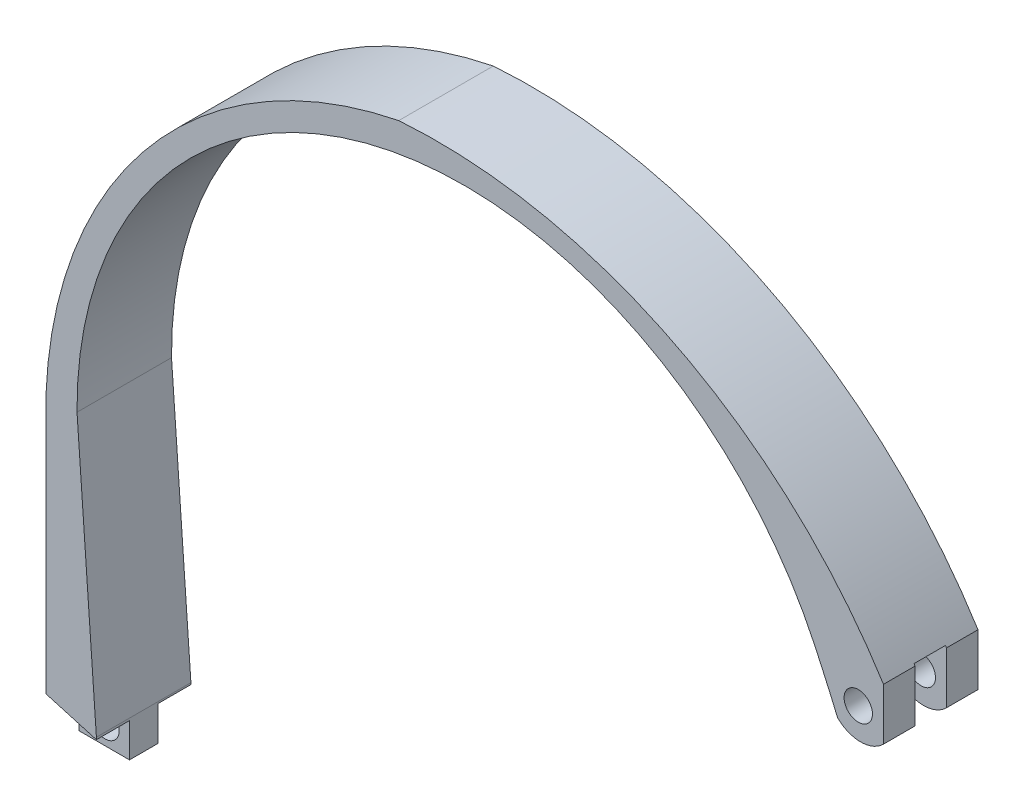
ISO-10303-21;
HEADER;
FILE_DESCRIPTION(('STEP AP214'),'2;1');
FILE_NAME('part.step','',(''),(''),'','','');
FILE_SCHEMA(('AUTOMOTIVE_DESIGN { 1 0 10303 214 1 1 1 1 }'));
ENDSEC;
DATA;
#1=APPLICATION_CONTEXT('core data for automotive mechanical design processes');
#2=APPLICATION_PROTOCOL_DEFINITION('international standard','automotive_design',2000,#1);
#3=PRODUCT_CONTEXT('',#1,'mechanical');
#4=PRODUCT('Part','Part','',(#3));
#5=PRODUCT_RELATED_PRODUCT_CATEGORY('part','',(#4));
#6=PRODUCT_DEFINITION_FORMATION('','',#4);
#7=PRODUCT_DEFINITION_CONTEXT('part definition',#1,'design');
#8=PRODUCT_DEFINITION('design','',#6,#7);
#9=PRODUCT_DEFINITION_SHAPE('','',#8);
#10=(LENGTH_UNIT() NAMED_UNIT(*) SI_UNIT(.MILLI.,.METRE.));
#11=(NAMED_UNIT(*) PLANE_ANGLE_UNIT() SI_UNIT($,.RADIAN.));
#12=(NAMED_UNIT(*) SI_UNIT($,.STERADIAN.) SOLID_ANGLE_UNIT());
#13=UNCERTAINTY_MEASURE_WITH_UNIT(LENGTH_MEASURE(1.E-05),#10,'distance_accuracy_value','');
#14=(GEOMETRIC_REPRESENTATION_CONTEXT(3) GLOBAL_UNCERTAINTY_ASSIGNED_CONTEXT((#13)) GLOBAL_UNIT_ASSIGNED_CONTEXT((#10,
#11,#12)) REPRESENTATION_CONTEXT('',''));
#15=CARTESIAN_POINT('',(0.,0.,0.));
#16=DIRECTION('',(0.,0.,1.));
#17=DIRECTION('',(1.,0.,0.));
#18=AXIS2_PLACEMENT_3D('',#15,#16,#17);
#19=CARTESIAN_POINT('',(41.6817567369252,115.412473793689,-15.));
#20=DIRECTION('',(1.,0.,0.));
#21=DIRECTION('',(0.,0.,-1.));
#22=AXIS2_PLACEMENT_3D('',#19,#20,#21);
#23=PLANE('',#22);
#24=DIRECTION('',(0.,-1.,0.));
#25=VECTOR('',#24,1.);
#26=CARTESIAN_POINT('',(41.6817567369252,115.671014255243,-5.01366928357319));
#27=LINE('',#26,#25);
#28=CARTESIAN_POINT('',(41.6817567369252,115.412473793689,-5.01366928357319));
#29=VERTEX_POINT('',#28);
#30=CARTESIAN_POINT('',(41.6817567369252,107.180744866332,-5.01366928357319));
#31=VERTEX_POINT('',#30);
#32=EDGE_CURVE('E186',#29,#31,#27,.T.);
#33=ORIENTED_EDGE('',*,*,#32,.F.);
#34=DIRECTION('',(0.,0.,1.));
#35=VECTOR('',#34,1.);
#36=CARTESIAN_POINT('',(41.6817567369252,115.412473793689,-15.));
#37=LINE('',#36,#35);
#38=CARTESIAN_POINT('',(41.6817567369252,115.412473793689,0.));
#39=VERTEX_POINT('',#38);
#40=EDGE_CURVE('E192',#29,#39,#37,.T.);
#41=ORIENTED_EDGE('',*,*,#40,.T.);
#42=DIRECTION('',(0.,1.,0.));
#43=VECTOR('',#42,1.);
#44=CARTESIAN_POINT('',(41.6817567369252,115.412473793689,0.));
#45=LINE('',#44,#43);
#46=CARTESIAN_POINT('',(41.6817567369252,107.180744866332,0.));
#47=VERTEX_POINT('',#46);
#48=EDGE_CURVE('E315',#47,#39,#45,.T.);
#49=ORIENTED_EDGE('',*,*,#48,.F.);
#50=DIRECTION('',(0.,0.,1.));
#51=VECTOR('',#50,1.);
#52=CARTESIAN_POINT('',(41.6817567369252,107.180744866332,-15.));
#53=LINE('',#52,#51);
#54=EDGE_CURVE('E193',#31,#47,#53,.T.);
#55=ORIENTED_EDGE('',*,*,#54,.F.);
#56=EDGE_LOOP('',(#33,#41,#49,#55));
#57=FACE_BOUND('',#56,.T.);
#58=ADVANCED_FACE('F32',(#57),#23,.T.);
#59=CARTESIAN_POINT('',(38.0369446201035,110.825556983154,-15.));
#60=DIRECTION('',(0.,0.,1.));
#61=DIRECTION('',(1.,0.,0.));
#62=AXIS2_PLACEMENT_3D('',#59,#60,#61);
#63=CYLINDRICAL_SURFACE('',#62,5.15454272791103);
#64=CARTESIAN_POINT('',(38.0369446201035,110.825556983154,-10.));
#65=DIRECTION('',(0.,0.,-1.));
#66=DIRECTION('',(0.,1.,0.));
#67=AXIS2_PLACEMENT_3D('',#64,#65,#66);
#68=CIRCLE('',#67,5.15454272791103);
#69=CARTESIAN_POINT('',(34.3921325032819,107.180744866332,-10.));
#70=VERTEX_POINT('',#69);
#71=CARTESIAN_POINT('',(41.6817567369252,107.180744866332,-10.));
#72=VERTEX_POINT('',#71);
#73=EDGE_CURVE('E166',#70,#72,#68,.F.);
#74=ORIENTED_EDGE('',*,*,#73,.F.);
#75=DIRECTION('',(0.,0.,1.));
#76=VECTOR('',#75,1.);
#77=CARTESIAN_POINT('',(34.3921325032818,107.180744866332,-15.));
#78=LINE('',#77,#76);
#79=CARTESIAN_POINT('',(34.3921325032818,107.180744866332,-15.));
#80=VERTEX_POINT('',#79);
#81=EDGE_CURVE('E196',#80,#70,#78,.T.);
#82=ORIENTED_EDGE('',*,*,#81,.F.);
#83=CARTESIAN_POINT('',(38.0369446201035,110.825556983154,-15.));
#84=DIRECTION('',(0.,0.,1.));
#85=DIRECTION('',(1.,0.,0.));
#86=AXIS2_PLACEMENT_3D('',#83,#84,#85);
#87=CIRCLE('',#86,5.15454272791103);
#88=CARTESIAN_POINT('',(41.6817567369252,107.180744866332,-15.));
#89=VERTEX_POINT('',#88);
#90=EDGE_CURVE('E191',#80,#89,#87,.T.);
#91=ORIENTED_EDGE('',*,*,#90,.T.);
#92=EDGE_CURVE('E183',#89,#72,#53,.T.);
#93=ORIENTED_EDGE('',*,*,#92,.T.);
#94=EDGE_LOOP('',(#74,#82,#91,#93));
#95=FACE_BOUND('',#94,.T.);
#96=ADVANCED_FACE('F189',(#95),#63,.T.);
#97=CARTESIAN_POINT('',(-180.992150634239,15.973031554718,-15.));
#98=DIRECTION('',(0.,0.,1.));
#99=DIRECTION('',(1.,0.,0.));
#100=AXIS2_PLACEMENT_3D('',#97,#98,#99);
#101=CYLINDRICAL_SURFACE('',#100,233.900056413412);
#102=CARTESIAN_POINT('',(-180.992150634239,15.973031554718,-5.01366928357319));
#103=DIRECTION('',(0.,0.,1.));
#104=DIRECTION('',(1.,0.,0.));
#105=AXIS2_PLACEMENT_3D('',#102,#103,#104);
#106=CIRCLE('',#105,233.900056413412);
#107=CARTESIAN_POINT('',(34.3921325032819,107.180744866332,-5.01366928357319));
#108=VERTEX_POINT('',#107);
#109=CARTESIAN_POINT('',(30.7176359071483,115.412473793689,-5.01366928357319));
#110=VERTEX_POINT('',#109);
#111=EDGE_CURVE('E225',#108,#110,#106,.T.);
#112=ORIENTED_EDGE('',*,*,#111,.F.);
#113=CARTESIAN_POINT('',(34.3921325032818,107.180744866332,0.));
#114=VERTEX_POINT('',#113);
#115=EDGE_CURVE('E200',#108,#114,#78,.T.);
#116=ORIENTED_EDGE('',*,*,#115,.T.);
#117=CARTESIAN_POINT('',(-180.992150634239,15.973031554718,0.));
#118=DIRECTION('',(0.,0.,-1.));
#119=DIRECTION('',(-1.,0.,0.));
#120=AXIS2_PLACEMENT_3D('',#117,#118,#119);
#121=CIRCLE('',#120,233.900056413412);
#122=CARTESIAN_POINT('',(30.7176359071483,115.412473793689,0.));
#123=VERTEX_POINT('',#122);
#124=EDGE_CURVE('E309',#123,#114,#121,.T.);
#125=ORIENTED_EDGE('',*,*,#124,.F.);
#126=DIRECTION('',(0.,0.,1.));
#127=VECTOR('',#126,1.);
#128=CARTESIAN_POINT('',(30.7176359071483,115.412473793689,-15.));
#129=LINE('',#128,#127);
#130=EDGE_CURVE('E204',#110,#123,#129,.T.);
#131=ORIENTED_EDGE('',*,*,#130,.F.);
#132=EDGE_LOOP('',(#112,#116,#125,#131));
#133=FACE_BOUND('',#132,.T.);
#134=ADVANCED_FACE('F421',(#133),#101,.F.);
#135=CARTESIAN_POINT('',(37.6817567369252,110.446980465343,-15.));
#136=DIRECTION('',(0.,0.,1.));
#137=DIRECTION('',(1.,0.,0.));
#138=AXIS2_PLACEMENT_3D('',#135,#136,#137);
#139=CYLINDRICAL_SURFACE('',#138,2.25);
#140=CARTESIAN_POINT('',(37.6817567369252,110.446980465343,-5.01366928357319));
#141=DIRECTION('',(0.,0.,1.));
#142=DIRECTION('',(1.,0.,0.));
#143=AXIS2_PLACEMENT_3D('',#140,#141,#142);
#144=CIRCLE('',#143,2.25);
#145=CARTESIAN_POINT('',(39.9317567369252,110.446980465343,-5.01366928357319));
#146=VERTEX_POINT('',#145);
#147=EDGE_CURVE('E220',#146,#146,#144,.F.);
#148=ORIENTED_EDGE('',*,*,#147,.T.);
#149=EDGE_LOOP('',(#148));
#150=FACE_BOUND('',#149,.T.);
#151=CARTESIAN_POINT('',(37.6817567369252,110.446980465343,0.));
#152=DIRECTION('',(0.,0.,1.));
#153=DIRECTION('',(1.,0.,0.));
#154=AXIS2_PLACEMENT_3D('',#151,#152,#153);
#155=CIRCLE('',#154,2.25);
#156=CARTESIAN_POINT('',(39.9317567369252,110.446980465343,0.));
#157=VERTEX_POINT('',#156);
#158=EDGE_CURVE('E214',#157,#157,#155,.T.);
#159=ORIENTED_EDGE('',*,*,#158,.T.);
#160=EDGE_LOOP('',(#159));
#161=FACE_BOUND('',#160,.T.);
#162=ADVANCED_FACE('F441',(#150,#161),#139,.F.);
#163=CARTESIAN_POINT('',(-91.2408376963351,39.9313785586785,-15.));
#164=DIRECTION('',(0.,-1.,0.));
#165=DIRECTION('',(0.,0.,-1.));
#166=AXIS2_PLACEMENT_3D('',#163,#164,#165);
#167=PLANE('',#166);
#168=DIRECTION('',(-1.,0.,0.));
#169=VECTOR('',#168,1.);
#170=CARTESIAN_POINT('',(-83.2408376963351,39.9313785586785,-9.75));
#171=LINE('',#170,#169);
#172=CARTESIAN_POINT('',(-83.2408376963351,39.9313785586785,-9.75));
#173=VERTEX_POINT('',#172);
#174=CARTESIAN_POINT('',(-91.2408376963351,39.9313785586785,-9.75));
#175=VERTEX_POINT('',#174);
#176=EDGE_CURVE('E246',#173,#175,#171,.T.);
#177=ORIENTED_EDGE('',*,*,#176,.F.);
#178=DIRECTION('',(0.,0.,1.));
#179=VECTOR('',#178,1.);
#180=CARTESIAN_POINT('',(-83.2408376963351,39.9313785586785,-15.));
#181=LINE('',#180,#179);
#182=CARTESIAN_POINT('',(-83.2408376963351,39.9313785586785,-5.25));
#183=VERTEX_POINT('',#182);
#184=EDGE_CURVE('E40',#173,#183,#181,.T.);
#185=ORIENTED_EDGE('',*,*,#184,.T.);
#186=DIRECTION('',(1.,0.,0.));
#187=VECTOR('',#186,1.);
#188=CARTESIAN_POINT('',(-83.2408376963351,39.9313785586785,-5.25));
#189=LINE('',#188,#187);
#190=CARTESIAN_POINT('',(-91.2408376963351,39.9313785586785,-5.25));
#191=VERTEX_POINT('',#190);
#192=EDGE_CURVE('E260',#191,#183,#189,.T.);
#193=ORIENTED_EDGE('',*,*,#192,.F.);
#194=DIRECTION('',(0.,0.,1.));
#195=VECTOR('',#194,1.);
#196=CARTESIAN_POINT('',(-91.2408376963351,39.9313785586785,-15.));
#197=LINE('',#196,#195);
#198=EDGE_CURVE('E327',#175,#191,#197,.T.);
#199=ORIENTED_EDGE('',*,*,#198,.F.);
#200=EDGE_LOOP('',(#177,#185,#193,#199));
#201=FACE_BOUND('',#200,.T.);
#202=ADVANCED_FACE('F402',(#201),#167,.T.);
#203=CARTESIAN_POINT('',(-87.1256184817804,43.1304804772085,-15.));
#204=DIRECTION('',(0.,0.,1.));
#205=DIRECTION('',(1.,0.,0.));
#206=AXIS2_PLACEMENT_3D('',#203,#204,#205);
#207=CYLINDRICAL_SURFACE('',#206,2.25000000000001);
#208=CARTESIAN_POINT('',(-87.1256184817804,43.1304804772085,-9.75));
#209=DIRECTION('',(0.,0.,1.));
#210=DIRECTION('',(1.,0.,0.));
#211=AXIS2_PLACEMENT_3D('',#208,#209,#210);
#212=CIRCLE('',#211,2.25000000000001);
#213=CARTESIAN_POINT('',(-84.8756184817804,43.1304804772085,-9.75));
#214=VERTEX_POINT('',#213);
#215=EDGE_CURVE('E252',#214,#214,#212,.F.);
#216=ORIENTED_EDGE('',*,*,#215,.T.);
#217=EDGE_LOOP('',(#216));
#218=FACE_BOUND('',#217,.T.);
#219=CARTESIAN_POINT('',(-87.1256184817804,43.1304804772085,-5.25));
#220=DIRECTION('',(0.,0.,1.));
#221=DIRECTION('',(1.,0.,0.));
#222=AXIS2_PLACEMENT_3D('',#219,#220,#221);
#223=CIRCLE('',#222,2.25000000000001);
#224=CARTESIAN_POINT('',(-84.8756184817804,43.1304804772085,-5.25));
#225=VERTEX_POINT('',#224);
#226=EDGE_CURVE('E211',#225,#225,#223,.F.);
#227=ORIENTED_EDGE('',*,*,#226,.F.);
#228=EDGE_LOOP('',(#227));
#229=FACE_BOUND('',#228,.T.);
#230=ADVANCED_FACE('F440',(#218,#229),#207,.F.);
#231=CARTESIAN_POINT('',(-83.2408376963351,39.9313785586785,-15.));
#232=DIRECTION('',(1.,0.,0.));
#233=DIRECTION('',(0.,0.,-1.));
#234=AXIS2_PLACEMENT_3D('',#231,#232,#233);
#235=PLANE('',#234);
#236=DIRECTION('',(0.,0.,-1.));
#237=VECTOR('',#236,1.);
#238=CARTESIAN_POINT('',(-83.2408376963351,45.4104786578847,-9.75));
#239=LINE('',#238,#237);
#240=CARTESIAN_POINT('',(-83.2408376963351,45.4104786578847,-9.75));
#241=VERTEX_POINT('',#240);
#242=CARTESIAN_POINT('',(-83.2408376963351,45.4104786578847,-15.));
#243=VERTEX_POINT('',#242);
#244=EDGE_CURVE('E249',#241,#243,#239,.T.);
#245=ORIENTED_EDGE('',*,*,#244,.T.);
#246=DIRECTION('',(0.,1.,0.));
#247=VECTOR('',#246,1.);
#248=CARTESIAN_POINT('',(-83.2408376963351,39.9313785586785,-15.));
#249=LINE('',#248,#247);
#250=CARTESIAN_POINT('',(-83.2408376963351,45.6800878076432,-15.));
#251=VERTEX_POINT('',#250);
#252=EDGE_CURVE('E279',#243,#251,#249,.T.);
#253=ORIENTED_EDGE('',*,*,#252,.T.);
#254=DIRECTION('',(0.,0.,1.));
#255=VECTOR('',#254,1.);
#256=CARTESIAN_POINT('',(-83.2408376963351,45.6800878076432,-15.));
#257=LINE('',#256,#255);
#258=CARTESIAN_POINT('',(-83.2408376963351,45.6800878076432,0.));
#259=VERTEX_POINT('',#258);
#260=EDGE_CURVE('E207',#251,#259,#257,.T.);
#261=ORIENTED_EDGE('',*,*,#260,.T.);
#262=DIRECTION('',(0.,1.,0.));
#263=VECTOR('',#262,1.);
#264=CARTESIAN_POINT('',(-83.2408376963351,39.9313785586785,0.));
#265=LINE('',#264,#263);
#266=CARTESIAN_POINT('',(-83.2408376963351,45.3360493469479,0.));
#267=VERTEX_POINT('',#266);
#268=EDGE_CURVE('E276',#267,#259,#265,.T.);
#269=ORIENTED_EDGE('',*,*,#268,.F.);
#270=DIRECTION('',(0.,0.,1.));
#271=VECTOR('',#270,1.);
#272=CARTESIAN_POINT('',(-83.2408376963351,45.3360493469479,-5.25));
#273=LINE('',#272,#271);
#274=CARTESIAN_POINT('',(-83.2408376963351,45.3360493469479,-5.25));
#275=VERTEX_POINT('',#274);
#276=EDGE_CURVE('E268',#275,#267,#273,.T.);
#277=ORIENTED_EDGE('',*,*,#276,.F.);
#278=DIRECTION('',(0.,1.,0.));
#279=VECTOR('',#278,1.);
#280=CARTESIAN_POINT('',(-83.2408376963351,45.3360493469479,-5.25));
#281=LINE('',#280,#279);
#282=EDGE_CURVE('E263',#183,#275,#281,.T.);
#283=ORIENTED_EDGE('',*,*,#282,.F.);
#284=ORIENTED_EDGE('',*,*,#184,.F.);
#285=DIRECTION('',(0.,-1.,0.));
#286=VECTOR('',#285,1.);
#287=CARTESIAN_POINT('',(-83.2408376963351,45.4104786578847,-9.75));
#288=LINE('',#287,#286);
#289=EDGE_CURVE('E244',#241,#173,#288,.T.);
#290=ORIENTED_EDGE('',*,*,#289,.F.);
#291=EDGE_LOOP('',(#245,#253,#261,#269,#277,#283,#284,#290));
#292=FACE_BOUND('',#291,.T.);
#293=ADVANCED_FACE('F34',(#292),#235,.T.);
#294=CARTESIAN_POINT('',(-91.2408376963352,47.6544502617802,-15.));
#295=DIRECTION('',(-1.,0.,0.));
#296=DIRECTION('',(0.,-1.,0.));
#297=AXIS2_PLACEMENT_3D('',#294,#295,#296);
#298=PLANE('',#297);
#299=DIRECTION('',(0.,0.,-1.));
#300=VECTOR('',#299,1.);
#301=CARTESIAN_POINT('',(-91.2408376963351,47.7188819468879,-9.75));
#302=LINE('',#301,#300);
#303=CARTESIAN_POINT('',(-91.2408376963351,47.7188819468879,-9.75));
#304=VERTEX_POINT('',#303);
#305=CARTESIAN_POINT('',(-91.2408376963352,47.7188819468879,-15.));
#306=VERTEX_POINT('',#305);
#307=EDGE_CURVE('E54',#304,#306,#302,.T.);
#308=ORIENTED_EDGE('',*,*,#307,.F.);
#309=DIRECTION('',(0.,1.,0.));
#310=VECTOR('',#309,1.);
#311=CARTESIAN_POINT('',(-91.2408376963351,39.9313785586785,-9.75));
#312=LINE('',#311,#310);
#313=EDGE_CURVE('E238',#175,#304,#312,.T.);
#314=ORIENTED_EDGE('',*,*,#313,.F.);
#315=ORIENTED_EDGE('',*,*,#198,.T.);
#316=DIRECTION('',(0.,-1.,0.));
#317=VECTOR('',#316,1.);
#318=CARTESIAN_POINT('',(-91.2408376963351,39.9313785586785,-5.25));
#319=LINE('',#318,#317);
#320=CARTESIAN_POINT('',(-91.2408376963351,47.6347286685338,-5.25));
#321=VERTEX_POINT('',#320);
#322=EDGE_CURVE('E257',#321,#191,#319,.T.);
#323=ORIENTED_EDGE('',*,*,#322,.F.);
#324=DIRECTION('',(0.,0.,1.));
#325=VECTOR('',#324,1.);
#326=CARTESIAN_POINT('',(-91.2408376963351,47.6347286685338,-5.25));
#327=LINE('',#326,#325);
#328=CARTESIAN_POINT('',(-91.2408376963351,47.6347286685338,0.));
#329=VERTEX_POINT('',#328);
#330=EDGE_CURVE('E215',#321,#329,#327,.T.);
#331=ORIENTED_EDGE('',*,*,#330,.T.);
#332=DIRECTION('',(0.,-1.,0.));
#333=VECTOR('',#332,1.);
#334=CARTESIAN_POINT('',(-91.2408376963352,47.6544502617802,0.));
#335=LINE('',#334,#333);
#336=CARTESIAN_POINT('',(-91.2408376963351,88.8069339708381,0.));
#337=VERTEX_POINT('',#336);
#338=EDGE_CURVE('E282',#337,#329,#335,.T.);
#339=ORIENTED_EDGE('',*,*,#338,.F.);
#340=DIRECTION('',(0.,0.,1.));
#341=VECTOR('',#340,1.);
#342=CARTESIAN_POINT('',(-91.2408376963351,88.8069339708381,-15.));
#343=LINE('',#342,#341);
#344=CARTESIAN_POINT('',(-91.2408376963351,88.8069339708381,-15.));
#345=VERTEX_POINT('',#344);
#346=EDGE_CURVE('E329',#345,#337,#343,.T.);
#347=ORIENTED_EDGE('',*,*,#346,.F.);
#348=DIRECTION('',(0.,-1.,0.));
#349=VECTOR('',#348,1.);
#350=CARTESIAN_POINT('',(-91.2408376963352,47.6544502617802,-15.));
#351=LINE('',#350,#349);
#352=EDGE_CURVE('E210',#345,#306,#351,.T.);
#353=ORIENTED_EDGE('',*,*,#352,.T.);
#354=EDGE_LOOP('',(#308,#314,#315,#323,#331,#339,#347,#353));
#355=FACE_BOUND('',#354,.T.);
#356=ADVANCED_FACE('F386',(#355),#298,.T.);
#357=CARTESIAN_POINT('',(-21.5663038245373,86.0562144369523,-15.));
#358=DIRECTION('',(0.,0.,1.));
#359=DIRECTION('',(1.,0.,0.));
#360=AXIS2_PLACEMENT_3D('',#357,#358,#359);
#361=CYLINDRICAL_SURFACE('',#360,69.7288113207618);
#362=CARTESIAN_POINT('',(-21.5663038245373,86.0562144369523,0.));
#363=DIRECTION('',(0.,0.,1.));
#364=DIRECTION('',(-1.,0.,0.));
#365=AXIS2_PLACEMENT_3D('',#362,#363,#364);
#366=CIRCLE('',#365,69.7288113207618);
#367=CARTESIAN_POINT('',(-35.2516455125783,154.428859194106,0.));
#368=VERTEX_POINT('',#367);
#369=EDGE_CURVE('E321',#368,#337,#366,.T.);
#370=ORIENTED_EDGE('',*,*,#369,.F.);
#371=DIRECTION('',(0.,0.,1.));
#372=VECTOR('',#371,1.);
#373=CARTESIAN_POINT('',(-35.2516455125783,154.428859194106,-15.));
#374=LINE('',#373,#372);
#375=CARTESIAN_POINT('',(-35.2516455125783,154.428859194106,-15.));
#376=VERTEX_POINT('',#375);
#377=EDGE_CURVE('E331',#376,#368,#374,.T.);
#378=ORIENTED_EDGE('',*,*,#377,.F.);
#379=CARTESIAN_POINT('',(-21.5663038245373,86.0562144369523,-15.));
#380=DIRECTION('',(0.,0.,1.));
#381=DIRECTION('',(-1.,0.,0.));
#382=AXIS2_PLACEMENT_3D('',#379,#380,#381);
#383=CIRCLE('',#382,69.7288113207618);
#384=EDGE_CURVE('E297',#376,#345,#383,.T.);
#385=ORIENTED_EDGE('',*,*,#384,.T.);
#386=ORIENTED_EDGE('',*,*,#346,.T.);
#387=EDGE_LOOP('',(#370,#378,#385,#386));
#388=FACE_BOUND('',#387,.T.);
#389=ADVANCED_FACE('F341',(#388),#361,.T.);
#390=CARTESIAN_POINT('',(-29.2118310731244,70.980588717436,-15.));
#391=DIRECTION('',(0.,0.,1.));
#392=DIRECTION('',(1.,0.,0.));
#393=AXIS2_PLACEMENT_3D('',#390,#391,#392);
#394=CYLINDRICAL_SURFACE('',#393,83.666559652053);
#395=CARTESIAN_POINT('',(-29.2118310731244,70.980588717436,-5.01366928357319));
#396=DIRECTION('',(0.,0.,1.));
#397=DIRECTION('',(1.,0.,0.));
#398=AXIS2_PLACEMENT_3D('',#395,#396,#397);
#399=CIRCLE('',#398,83.666559652053);
#400=CARTESIAN_POINT('',(41.5190608289312,115.671014255243,-5.01366928357319));
#401=VERTEX_POINT('',#400);
#402=EDGE_CURVE('E233',#401,#29,#399,.F.);
#403=ORIENTED_EDGE('',*,*,#402,.F.);
#404=DIRECTION('',(0.,0.,1.));
#405=VECTOR('',#404,1.);
#406=CARTESIAN_POINT('',(41.5190608289312,115.671014255243,-15.));
#407=LINE('',#406,#405);
#408=CARTESIAN_POINT('',(41.5190608289312,115.671014255243,-10.));
#409=VERTEX_POINT('',#408);
#410=EDGE_CURVE('E235',#409,#401,#407,.T.);
#411=ORIENTED_EDGE('',*,*,#410,.F.);
#412=CARTESIAN_POINT('',(-29.2118310731244,70.980588717436,-10.));
#413=DIRECTION('',(0.,0.,-1.));
#414=DIRECTION('',(0.,1.,0.));
#415=AXIS2_PLACEMENT_3D('',#412,#413,#414);
#416=CIRCLE('',#415,83.666559652053);
#417=CARTESIAN_POINT('',(41.6817567369252,115.412473793689,-10.));
#418=VERTEX_POINT('',#417);
#419=EDGE_CURVE('E177',#418,#409,#416,.F.);
#420=ORIENTED_EDGE('',*,*,#419,.F.);
#421=CARTESIAN_POINT('',(41.6817567369252,115.412473793689,-15.));
#422=VERTEX_POINT('',#421);
#423=EDGE_CURVE('E185',#422,#418,#37,.T.);
#424=ORIENTED_EDGE('',*,*,#423,.F.);
#425=CARTESIAN_POINT('',(-29.2118310731244,70.980588717436,-15.));
#426=DIRECTION('',(0.,0.,1.));
#427=DIRECTION('',(-1.,0.,0.));
#428=AXIS2_PLACEMENT_3D('',#425,#426,#427);
#429=CIRCLE('',#428,83.666559652053);
#430=EDGE_CURVE('E294',#422,#376,#429,.T.);
#431=ORIENTED_EDGE('',*,*,#430,.T.);
#432=ORIENTED_EDGE('',*,*,#377,.T.);
#433=CARTESIAN_POINT('',(-29.2118310731244,70.980588717436,0.));
#434=DIRECTION('',(0.,0.,1.));
#435=DIRECTION('',(-1.,0.,0.));
#436=AXIS2_PLACEMENT_3D('',#433,#434,#435);
#437=CIRCLE('',#436,83.666559652053);
#438=EDGE_CURVE('E318',#39,#368,#437,.T.);
#439=ORIENTED_EDGE('',*,*,#438,.F.);
#440=ORIENTED_EDGE('',*,*,#40,.F.);
#441=EDGE_LOOP('',(#403,#411,#420,#424,#431,#432,#439,#440));
#442=FACE_BOUND('',#441,.T.);
#443=ADVANCED_FACE('F336',(#442),#394,.T.);
#444=DIRECTION('',(0.,1.,0.));
#445=VECTOR('',#444,1.);
#446=CARTESIAN_POINT('',(41.6817567369252,115.671014255243,-10.));
#447=LINE('',#446,#445);
#448=EDGE_CURVE('E170',#72,#418,#447,.T.);
#449=ORIENTED_EDGE('',*,*,#448,.F.);
#450=ORIENTED_EDGE('',*,*,#92,.F.);
#451=DIRECTION('',(0.,1.,0.));
#452=VECTOR('',#451,1.);
#453=CARTESIAN_POINT('',(41.6817567369252,115.412473793689,-15.));
#454=LINE('',#453,#452);
#455=EDGE_CURVE('E292',#89,#422,#454,.T.);
#456=ORIENTED_EDGE('',*,*,#455,.T.);
#457=ORIENTED_EDGE('',*,*,#423,.T.);
#458=EDGE_LOOP('',(#449,#450,#456,#457));
#459=FACE_BOUND('',#458,.T.);
#460=ADVANCED_FACE('F181',(#459),#23,.T.);
#461=CARTESIAN_POINT('',(38.0369446201035,110.825556983154,-5.01366928357319));
#462=DIRECTION('',(0.,0.,1.));
#463=DIRECTION('',(1.,0.,0.));
#464=AXIS2_PLACEMENT_3D('',#461,#462,#463);
#465=CIRCLE('',#464,5.15454272791103);
#466=EDGE_CURVE('E231',#31,#108,#465,.F.);
#467=ORIENTED_EDGE('',*,*,#466,.F.);
#468=ORIENTED_EDGE('',*,*,#54,.T.);
#469=CARTESIAN_POINT('',(38.0369446201035,110.825556983154,0.));
#470=DIRECTION('',(0.,0.,1.));
#471=DIRECTION('',(1.,0.,0.));
#472=AXIS2_PLACEMENT_3D('',#469,#470,#471);
#473=CIRCLE('',#472,5.15454272791103);
#474=EDGE_CURVE('E312',#114,#47,#473,.T.);
#475=ORIENTED_EDGE('',*,*,#474,.F.);
#476=ORIENTED_EDGE('',*,*,#115,.F.);
#477=EDGE_LOOP('',(#467,#468,#475,#476));
#478=FACE_BOUND('',#477,.T.);
#479=ADVANCED_FACE('F423',(#478),#63,.T.);
#480=CARTESIAN_POINT('',(-180.992150634239,15.973031554718,-10.));
#481=DIRECTION('',(0.,0.,-1.));
#482=DIRECTION('',(0.,1.,0.));
#483=AXIS2_PLACEMENT_3D('',#480,#481,#482);
#484=CIRCLE('',#483,233.900056413412);
#485=CARTESIAN_POINT('',(30.7176359071483,115.412473793689,-10.));
#486=VERTEX_POINT('',#485);
#487=EDGE_CURVE('E173',#486,#70,#484,.T.);
#488=ORIENTED_EDGE('',*,*,#487,.F.);
#489=CARTESIAN_POINT('',(30.7176359071483,115.412473793689,-15.));
#490=VERTEX_POINT('',#489);
#491=EDGE_CURVE('E201',#490,#486,#129,.T.);
#492=ORIENTED_EDGE('',*,*,#491,.F.);
#493=CARTESIAN_POINT('',(-180.992150634239,15.973031554718,-15.));
#494=DIRECTION('',(0.,0.,-1.));
#495=DIRECTION('',(-1.,0.,0.));
#496=AXIS2_PLACEMENT_3D('',#493,#494,#495);
#497=CIRCLE('',#496,233.900056413412);
#498=EDGE_CURVE('E288',#490,#80,#497,.T.);
#499=ORIENTED_EDGE('',*,*,#498,.T.);
#500=ORIENTED_EDGE('',*,*,#81,.T.);
#501=EDGE_LOOP('',(#488,#492,#499,#500));
#502=FACE_BOUND('',#501,.T.);
#503=ADVANCED_FACE('F366',(#502),#101,.F.);
#504=CARTESIAN_POINT('',(-24.8871761419882,89.295062849684,-15.));
#505=DIRECTION('',(0.,0.,1.));
#506=DIRECTION('',(1.,0.,0.));
#507=AXIS2_PLACEMENT_3D('',#504,#505,#506);
#508=CYLINDRICAL_SURFACE('',#507,61.4330064170541);
#509=CARTESIAN_POINT('',(-24.8871761419882,89.295062849684,-5.01366928357319));
#510=DIRECTION('',(0.,0.,1.));
#511=DIRECTION('',(1.,0.,0.));
#512=AXIS2_PLACEMENT_3D('',#509,#510,#511);
#513=CIRCLE('',#512,61.4330064170541);
#514=CARTESIAN_POINT('',(30.595464971151,115.671014255243,-5.01366928357319));
#515=VERTEX_POINT('',#514);
#516=EDGE_CURVE('E222',#110,#515,#513,.T.);
#517=ORIENTED_EDGE('',*,*,#516,.F.);
#518=ORIENTED_EDGE('',*,*,#130,.T.);
#519=CARTESIAN_POINT('',(-24.8871761419882,89.295062849684,0.));
#520=DIRECTION('',(0.,0.,-1.));
#521=DIRECTION('',(-1.,0.,0.));
#522=AXIS2_PLACEMENT_3D('',#519,#520,#521);
#523=CIRCLE('',#522,61.4330064170541);
#524=CARTESIAN_POINT('',(-86.3182432630748,88.8069339708381,0.));
#525=VERTEX_POINT('',#524);
#526=EDGE_CURVE('E306',#525,#123,#523,.T.);
#527=ORIENTED_EDGE('',*,*,#526,.F.);
#528=DIRECTION('',(0.,0.,1.));
#529=VECTOR('',#528,1.);
#530=CARTESIAN_POINT('',(-86.3182432630748,88.8069339708381,-15.));
#531=LINE('',#530,#529);
#532=CARTESIAN_POINT('',(-86.3182432630748,88.8069339708381,-15.));
#533=VERTEX_POINT('',#532);
#534=EDGE_CURVE('E205',#533,#525,#531,.T.);
#535=ORIENTED_EDGE('',*,*,#534,.F.);
#536=CARTESIAN_POINT('',(-24.8871761419882,89.295062849684,-15.));
#537=DIRECTION('',(0.,0.,-1.));
#538=DIRECTION('',(-1.,0.,0.));
#539=AXIS2_PLACEMENT_3D('',#536,#537,#538);
#540=CIRCLE('',#539,61.4330064170541);
#541=EDGE_CURVE('E285',#533,#490,#540,.T.);
#542=ORIENTED_EDGE('',*,*,#541,.T.);
#543=ORIENTED_EDGE('',*,*,#491,.T.);
#544=CARTESIAN_POINT('',(-24.8871761419882,89.295062849684,-10.));
#545=DIRECTION('',(0.,0.,-1.));
#546=DIRECTION('',(0.,1.,0.));
#547=AXIS2_PLACEMENT_3D('',#544,#545,#546);
#548=CIRCLE('',#547,61.4330064170541);
#549=CARTESIAN_POINT('',(30.595464971151,115.671014255243,-10.));
#550=VERTEX_POINT('',#549);
#551=EDGE_CURVE('E218',#550,#486,#548,.T.);
#552=ORIENTED_EDGE('',*,*,#551,.F.);
#553=DIRECTION('',(0.,0.,1.));
#554=VECTOR('',#553,1.);
#555=CARTESIAN_POINT('',(30.595464971151,115.671014255243,-15.));
#556=LINE('',#555,#554);
#557=EDGE_CURVE('E11',#515,#550,#556,.F.);
#558=ORIENTED_EDGE('',*,*,#557,.F.);
#559=EDGE_LOOP('',(#517,#518,#527,#535,#542,#543,#552,#558));
#560=FACE_BOUND('',#559,.T.);
#561=ADVANCED_FACE('F368',(#560),#508,.F.);
#562=CARTESIAN_POINT('',(-83.2408376963351,45.6800878076432,-15.));
#563=DIRECTION('',(0.997463765433443,0.0711760960388903,0.));
#564=DIRECTION('',(-0.0711760960388903,0.997463765433443,0.));
#565=AXIS2_PLACEMENT_3D('',#562,#563,#564);
#566=PLANE('',#565);
#567=DIRECTION('',(-0.0711760960388903,0.997463765433443,0.));
#568=VECTOR('',#567,1.);
#569=CARTESIAN_POINT('',(-83.2408376963351,45.6800878076432,0.));
#570=LINE('',#569,#568);
#571=EDGE_CURVE('E303',#259,#525,#570,.T.);
#572=ORIENTED_EDGE('',*,*,#571,.F.);
#573=ORIENTED_EDGE('',*,*,#260,.F.);
#574=DIRECTION('',(-0.0711760960388903,0.997463765433443,0.));
#575=VECTOR('',#574,1.);
#576=CARTESIAN_POINT('',(-83.2408376963351,45.6800878076432,-15.));
#577=LINE('',#576,#575);
#578=EDGE_CURVE('E281',#251,#533,#577,.T.);
#579=ORIENTED_EDGE('',*,*,#578,.T.);
#580=ORIENTED_EDGE('',*,*,#534,.T.);
#581=EDGE_LOOP('',(#572,#573,#579,#580));
#582=FACE_BOUND('',#581,.T.);
#583=ADVANCED_FACE('F379',(#582),#566,.T.);
#584=CARTESIAN_POINT('',(-24.8871761419882,89.295062849684,-15.));
#585=DIRECTION('',(0.,0.,-1.));
#586=DIRECTION('',(-1.,0.,0.));
#587=AXIS2_PLACEMENT_3D('',#584,#585,#586);
#588=PLANE('',#587);
#589=DIRECTION('',(0.960800848662056,-0.277239479891073,0.));
#590=VECTOR('',#589,1.);
#591=CARTESIAN_POINT('',(-91.2408376963351,47.7188819468879,-15.));
#592=LINE('',#591,#590);
#593=EDGE_CURVE('E237',#306,#243,#592,.T.);
#594=ORIENTED_EDGE('',*,*,#593,.F.);
#595=ORIENTED_EDGE('',*,*,#352,.F.);
#596=ORIENTED_EDGE('',*,*,#384,.F.);
#597=ORIENTED_EDGE('',*,*,#430,.F.);
#598=ORIENTED_EDGE('',*,*,#455,.F.);
#599=ORIENTED_EDGE('',*,*,#90,.F.);
#600=ORIENTED_EDGE('',*,*,#498,.F.);
#601=ORIENTED_EDGE('',*,*,#541,.F.);
#602=ORIENTED_EDGE('',*,*,#578,.F.);
#603=ORIENTED_EDGE('',*,*,#252,.F.);
#604=EDGE_LOOP('',(#594,#595,#596,#597,#598,#599,#600,#601,#602,#603));
#605=FACE_BOUND('',#604,.T.);
#606=CARTESIAN_POINT('',(37.6817567369252,110.446980465343,-15.));
#607=DIRECTION('',(0.,0.,1.));
#608=DIRECTION('',(1.,0.,0.));
#609=AXIS2_PLACEMENT_3D('',#606,#607,#608);
#610=CIRCLE('',#609,2.25);
#611=CARTESIAN_POINT('',(39.9317567369252,110.446980465343,-15.));
#612=VERTEX_POINT('',#611);
#613=EDGE_CURVE('E273',#612,#612,#610,.T.);
#614=ORIENTED_EDGE('',*,*,#613,.T.);
#615=EDGE_LOOP('',(#614));
#616=FACE_BOUND('',#615,.T.);
#617=ADVANCED_FACE('F373',(#605,#616),#588,.T.);
#618=CARTESIAN_POINT('',(-24.8871761419882,89.295062849684,0.));
#619=DIRECTION('',(0.,0.,-1.));
#620=DIRECTION('',(-1.,0.,0.));
#621=AXIS2_PLACEMENT_3D('',#618,#619,#620);
#622=PLANE('',#621);
#623=ORIENTED_EDGE('',*,*,#158,.F.);
#624=EDGE_LOOP('',(#623));
#625=FACE_BOUND('',#624,.T.);
#626=ORIENTED_EDGE('',*,*,#338,.T.);
#627=DIRECTION('',(-0.961111426310304,0.276160870174928,0.));
#628=VECTOR('',#627,1.);
#629=CARTESIAN_POINT('',(-91.2408376963351,47.6347286685338,0.));
#630=LINE('',#629,#628);
#631=EDGE_CURVE('E256',#267,#329,#630,.T.);
#632=ORIENTED_EDGE('',*,*,#631,.F.);
#633=ORIENTED_EDGE('',*,*,#268,.T.);
#634=ORIENTED_EDGE('',*,*,#571,.T.);
#635=ORIENTED_EDGE('',*,*,#526,.T.);
#636=ORIENTED_EDGE('',*,*,#124,.T.);
#637=ORIENTED_EDGE('',*,*,#474,.T.);
#638=ORIENTED_EDGE('',*,*,#48,.T.);
#639=ORIENTED_EDGE('',*,*,#438,.T.);
#640=ORIENTED_EDGE('',*,*,#369,.T.);
#641=EDGE_LOOP('',(#626,#632,#633,#634,#635,#636,#637,#638,#639,#640));
#642=FACE_BOUND('',#641,.T.);
#643=ADVANCED_FACE('F343',(#625,#642),#622,.F.);
#644=CARTESIAN_POINT('',(37.6817567369252,110.446980465343,-10.));
#645=DIRECTION('',(0.,0.,-1.));
#646=DIRECTION('',(0.,1.,0.));
#647=AXIS2_PLACEMENT_3D('',#644,#645,#646);
#648=CIRCLE('',#647,2.25);
#649=CARTESIAN_POINT('',(37.6817567369252,112.696980465343,-10.));
#650=VERTEX_POINT('',#649);
#651=EDGE_CURVE('E216',#650,#650,#648,.F.);
#652=ORIENTED_EDGE('',*,*,#651,.T.);
#653=EDGE_LOOP('',(#652));
#654=FACE_BOUND('',#653,.T.);
#655=ORIENTED_EDGE('',*,*,#613,.F.);
#656=EDGE_LOOP('',(#655));
#657=FACE_BOUND('',#656,.T.);
#658=ADVANCED_FACE('F444',(#654,#657),#139,.F.);
#659=CARTESIAN_POINT('',(0.,0.,-5.25));
#660=DIRECTION('',(0.,0.,1.));
#661=DIRECTION('',(1.,0.,0.));
#662=AXIS2_PLACEMENT_3D('',#659,#660,#661);
#663=PLANE('',#662);
#664=ORIENTED_EDGE('',*,*,#322,.T.);
#665=ORIENTED_EDGE('',*,*,#192,.T.);
#666=ORIENTED_EDGE('',*,*,#282,.T.);
#667=DIRECTION('',(-0.961111426310304,0.276160870174928,0.));
#668=VECTOR('',#667,1.);
#669=CARTESIAN_POINT('',(-91.2408376963351,47.6347286685338,-5.25));
#670=LINE('',#669,#668);
#671=EDGE_CURVE('E265',#275,#321,#670,.T.);
#672=ORIENTED_EDGE('',*,*,#671,.T.);
#673=EDGE_LOOP('',(#664,#665,#666,#672));
#674=FACE_BOUND('',#673,.T.);
#675=ORIENTED_EDGE('',*,*,#226,.T.);
#676=EDGE_LOOP('',(#675));
#677=FACE_BOUND('',#676,.T.);
#678=ADVANCED_FACE('F396',(#674,#677),#663,.T.);
#679=CARTESIAN_POINT('',(-91.2408376963351,47.6347286685338,-5.25));
#680=DIRECTION('',(0.276160870174928,0.961111426310304,0.));
#681=DIRECTION('',(-0.961111426310304,0.276160870174928,0.));
#682=AXIS2_PLACEMENT_3D('',#679,#680,#681);
#683=PLANE('',#682);
#684=ORIENTED_EDGE('',*,*,#631,.T.);
#685=ORIENTED_EDGE('',*,*,#330,.F.);
#686=ORIENTED_EDGE('',*,*,#671,.F.);
#687=ORIENTED_EDGE('',*,*,#276,.T.);
#688=EDGE_LOOP('',(#684,#685,#686,#687));
#689=FACE_BOUND('',#688,.T.);
#690=ADVANCED_FACE('F391',(#689),#683,.F.);
#691=CARTESIAN_POINT('',(0.,0.,-9.75));
#692=DIRECTION('',(0.,0.,1.));
#693=DIRECTION('',(1.,0.,0.));
#694=AXIS2_PLACEMENT_3D('',#691,#692,#693);
#695=PLANE('',#694);
#696=ORIENTED_EDGE('',*,*,#313,.T.);
#697=DIRECTION('',(0.960800848662056,-0.277239479891073,0.));
#698=VECTOR('',#697,1.);
#699=CARTESIAN_POINT('',(-91.2408376963351,47.7188819468879,-9.75));
#700=LINE('',#699,#698);
#701=EDGE_CURVE('E241',#304,#241,#700,.T.);
#702=ORIENTED_EDGE('',*,*,#701,.T.);
#703=ORIENTED_EDGE('',*,*,#289,.T.);
#704=ORIENTED_EDGE('',*,*,#176,.T.);
#705=EDGE_LOOP('',(#696,#702,#703,#704));
#706=FACE_BOUND('',#705,.T.);
#707=ORIENTED_EDGE('',*,*,#215,.F.);
#708=EDGE_LOOP('',(#707));
#709=FACE_BOUND('',#708,.T.);
#710=ADVANCED_FACE('F404',(#706,#709),#695,.F.);
#711=CARTESIAN_POINT('',(-91.2408376963351,47.7188819468879,-9.75));
#712=DIRECTION('',(0.277239479891073,0.960800848662056,0.));
#713=DIRECTION('',(-0.960800848662056,0.277239479891073,0.));
#714=AXIS2_PLACEMENT_3D('',#711,#712,#713);
#715=PLANE('',#714);
#716=ORIENTED_EDGE('',*,*,#593,.T.);
#717=ORIENTED_EDGE('',*,*,#244,.F.);
#718=ORIENTED_EDGE('',*,*,#701,.F.);
#719=ORIENTED_EDGE('',*,*,#307,.T.);
#720=EDGE_LOOP('',(#716,#717,#718,#719));
#721=FACE_BOUND('',#720,.T.);
#722=ADVANCED_FACE('F406',(#721),#715,.F.);
#723=CARTESIAN_POINT('',(21.6817567369252,115.671014255243,-5.01366928357319));
#724=DIRECTION('',(0.,0.,1.));
#725=DIRECTION('',(1.,0.,0.));
#726=AXIS2_PLACEMENT_3D('',#723,#724,#725);
#727=PLANE('',#726);
#728=ORIENTED_EDGE('',*,*,#402,.T.);
#729=ORIENTED_EDGE('',*,*,#32,.T.);
#730=ORIENTED_EDGE('',*,*,#466,.T.);
#731=ORIENTED_EDGE('',*,*,#111,.T.);
#732=ORIENTED_EDGE('',*,*,#516,.T.);
#733=DIRECTION('',(1.,0.,0.));
#734=VECTOR('',#733,1.);
#735=CARTESIAN_POINT('',(21.6817567369252,115.671014255243,-5.01366928357319));
#736=LINE('',#735,#734);
#737=EDGE_CURVE('E219',#515,#401,#736,.T.);
#738=ORIENTED_EDGE('',*,*,#737,.T.);
#739=EDGE_LOOP('',(#728,#729,#730,#731,#732,#738));
#740=FACE_BOUND('',#739,.T.);
#741=ORIENTED_EDGE('',*,*,#147,.F.);
#742=EDGE_LOOP('',(#741));
#743=FACE_BOUND('',#742,.T.);
#744=ADVANCED_FACE('F352',(#740,#743),#727,.F.);
#745=CARTESIAN_POINT('',(21.6817567369252,115.671014255243,-10.));
#746=DIRECTION('',(0.,0.,-1.));
#747=DIRECTION('',(0.,1.,0.));
#748=AXIS2_PLACEMENT_3D('',#745,#746,#747);
#749=PLANE('',#748);
#750=ORIENTED_EDGE('',*,*,#419,.T.);
#751=DIRECTION('',(1.,0.,0.));
#752=VECTOR('',#751,1.);
#753=CARTESIAN_POINT('',(21.6817567369252,115.671014255243,-10.));
#754=LINE('',#753,#752);
#755=EDGE_CURVE('E47',#550,#409,#754,.T.);
#756=ORIENTED_EDGE('',*,*,#755,.F.);
#757=ORIENTED_EDGE('',*,*,#551,.T.);
#758=ORIENTED_EDGE('',*,*,#487,.T.);
#759=ORIENTED_EDGE('',*,*,#73,.T.);
#760=ORIENTED_EDGE('',*,*,#448,.T.);
#761=EDGE_LOOP('',(#750,#756,#757,#758,#759,#760));
#762=FACE_BOUND('',#761,.T.);
#763=ORIENTED_EDGE('',*,*,#651,.F.);
#764=EDGE_LOOP('',(#763));
#765=FACE_BOUND('',#764,.T.);
#766=ADVANCED_FACE('F168',(#762,#765),#749,.F.);
#767=CARTESIAN_POINT('',(21.6817567369252,115.671014255243,-5.01366928357319));
#768=DIRECTION('',(0.,1.,0.));
#769=DIRECTION('',(0.,0.,1.));
#770=AXIS2_PLACEMENT_3D('',#767,#768,#769);
#771=PLANE('',#770);
#772=ORIENTED_EDGE('',*,*,#410,.T.);
#773=ORIENTED_EDGE('',*,*,#737,.F.);
#774=ORIENTED_EDGE('',*,*,#557,.T.);
#775=ORIENTED_EDGE('',*,*,#755,.T.);
#776=EDGE_LOOP('',(#772,#773,#774,#775));
#777=FACE_BOUND('',#776,.T.);
#778=ADVANCED_FACE('F557',(#777),#771,.F.);
#779=CLOSED_SHELL('',(#58,#96,#134,#162,#202,#230,#293,#356,#389,#443,#460,#479,#503,#561,#583,
#617,#643,#658,#678,#690,#710,#722,#744,#766,#778));
#780=MANIFOLD_SOLID_BREP('B2',#779);
#781=ADVANCED_BREP_SHAPE_REPRESENTATION('',(#18,#780),#14);
#782=SHAPE_DEFINITION_REPRESENTATION(#9,#781);
ENDSEC;
END-ISO-10303-21;
